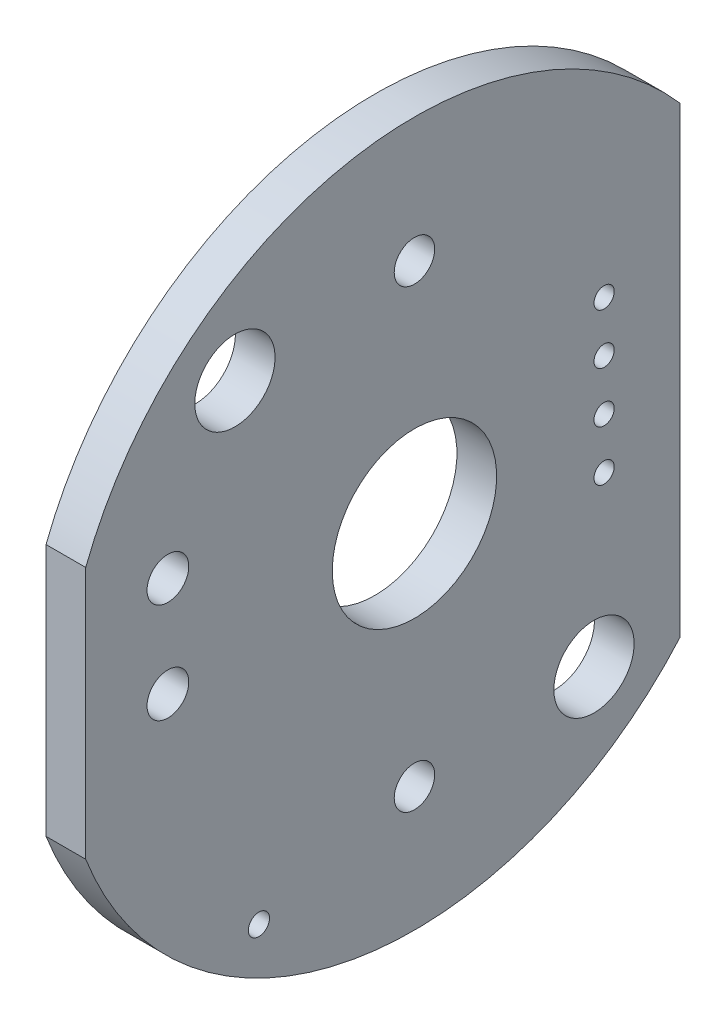
ISO-10303-21;
HEADER;
FILE_DESCRIPTION(('STEP AP214'),'2;1');
FILE_NAME('part.step','',(''),(''),'','','');
FILE_SCHEMA(('AUTOMOTIVE_DESIGN { 1 0 10303 214 1 1 1 1 }'));
ENDSEC;
DATA;
#1=APPLICATION_CONTEXT('core data for automotive mechanical design processes');
#2=APPLICATION_PROTOCOL_DEFINITION('international standard','automotive_design',2000,#1);
#3=PRODUCT_CONTEXT('',#1,'mechanical');
#4=PRODUCT('Part','Part','',(#3));
#5=PRODUCT_RELATED_PRODUCT_CATEGORY('part','',(#4));
#6=PRODUCT_DEFINITION_FORMATION('','',#4);
#7=PRODUCT_DEFINITION_CONTEXT('part definition',#1,'design');
#8=PRODUCT_DEFINITION('design','',#6,#7);
#9=PRODUCT_DEFINITION_SHAPE('','',#8);
#10=(LENGTH_UNIT() NAMED_UNIT(*) SI_UNIT(.MILLI.,.METRE.));
#11=(NAMED_UNIT(*) PLANE_ANGLE_UNIT() SI_UNIT($,.RADIAN.));
#12=(NAMED_UNIT(*) SI_UNIT($,.STERADIAN.) SOLID_ANGLE_UNIT());
#13=UNCERTAINTY_MEASURE_WITH_UNIT(LENGTH_MEASURE(1.E-05),#10,'distance_accuracy_value','');
#14=(GEOMETRIC_REPRESENTATION_CONTEXT(3) GLOBAL_UNCERTAINTY_ASSIGNED_CONTEXT((#13)) GLOBAL_UNIT_ASSIGNED_CONTEXT((#10,
#11,#12)) REPRESENTATION_CONTEXT('',''));
#15=CARTESIAN_POINT('',(0.,0.,0.));
#16=DIRECTION('',(0.,0.,1.));
#17=DIRECTION('',(1.,0.,0.));
#18=AXIS2_PLACEMENT_3D('',#15,#16,#17);
#19=CARTESIAN_POINT('',(-71.0500000000008,0.,0.344796446042563));
#20=DIRECTION('',(-1.,0.,0.));
#21=DIRECTION('',(0.,0.,1.));
#22=AXIS2_PLACEMENT_3D('',#19,#20,#21);
#23=PLANE('',#22);
#24=DIRECTION('',(0.,-1.,0.));
#25=VECTOR('',#24,1.);
#26=CARTESIAN_POINT('',(-71.0500000000008,-9.15,-10.5));
#27=LINE('',#26,#25);
#28=CARTESIAN_POINT('',(-71.0500000000008,9.14993426291181,-10.5));
#29=VERTEX_POINT('',#28);
#30=CARTESIAN_POINT('',(-71.0500000000008,-9.14993426291164,-10.5));
#31=VERTEX_POINT('',#30);
#32=EDGE_CURVE('E170',#29,#31,#27,.T.);
#33=ORIENTED_EDGE('',*,*,#32,.F.);
#34=CARTESIAN_POINT('',(-71.0500000000008,0.,0.));
#35=DIRECTION('',(-1.,0.,0.));
#36=DIRECTION('',(0.,-1.,0.));
#37=AXIS2_PLACEMENT_3D('',#34,#35,#36);
#38=CIRCLE('',#37,13.9273578619782);
#39=CARTESIAN_POINT('',(-71.0500000000008,4.99712887722608,13.));
#40=VERTEX_POINT('',#39);
#41=EDGE_CURVE('E197',#40,#29,#38,.T.);
#42=ORIENTED_EDGE('',*,*,#41,.F.);
#43=DIRECTION('',(0.,1.,0.));
#44=VECTOR('',#43,1.);
#45=CARTESIAN_POINT('',(-71.0500000000008,5.00000000000009,13.));
#46=LINE('',#45,#44);
#47=CARTESIAN_POINT('',(-71.0500000000008,-4.99712887722591,13.));
#48=VERTEX_POINT('',#47);
#49=EDGE_CURVE('E204',#48,#40,#46,.T.);
#50=ORIENTED_EDGE('',*,*,#49,.F.);
#51=CARTESIAN_POINT('',(-71.0500000000008,0.,0.));
#52=DIRECTION('',(-1.,0.,0.));
#53=DIRECTION('',(0.,-1.,0.));
#54=AXIS2_PLACEMENT_3D('',#51,#52,#53);
#55=CIRCLE('',#54,13.9273578619782);
#56=EDGE_CURVE('E11',#31,#48,#55,.T.);
#57=ORIENTED_EDGE('',*,*,#56,.F.);
#58=EDGE_LOOP('',(#33,#42,#50,#57));
#59=FACE_BOUND('',#58,.T.);
#60=CARTESIAN_POINT('',(-71.0500000000008,-9.,0.));
#61=DIRECTION('',(-1.,0.,0.));
#62=DIRECTION('',(0.,0.,1.));
#63=AXIS2_PLACEMENT_3D('',#60,#61,#62);
#64=CIRCLE('',#63,0.8001);
#65=CARTESIAN_POINT('',(-71.0500000000008,-9.,0.800099999999991));
#66=VERTEX_POINT('',#65);
#67=EDGE_CURVE('E20',#66,#66,#64,.T.);
#68=ORIENTED_EDGE('',*,*,#67,.T.);
#69=EDGE_LOOP('',(#68));
#70=FACE_BOUND('',#69,.T.);
#71=CARTESIAN_POINT('',(-71.0500000000008,9.,0.));
#72=DIRECTION('',(-1.,0.,0.));
#73=DIRECTION('',(0.,0.,1.));
#74=AXIS2_PLACEMENT_3D('',#71,#72,#73);
#75=CIRCLE('',#74,0.8001);
#76=CARTESIAN_POINT('',(-71.0500000000008,9.,0.800099999999991));
#77=VERTEX_POINT('',#76);
#78=EDGE_CURVE('E231',#77,#77,#75,.T.);
#79=ORIENTED_EDGE('',*,*,#78,.T.);
#80=EDGE_LOOP('',(#79));
#81=FACE_BOUND('',#80,.T.);
#82=CARTESIAN_POINT('',(-71.0500000000008,-8.44999999999991,-7.1));
#83=DIRECTION('',(-1.,0.,0.));
#84=DIRECTION('',(0.,0.,1.));
#85=AXIS2_PLACEMENT_3D('',#82,#83,#84);
#86=CIRCLE('',#85,1.5875);
#87=CARTESIAN_POINT('',(-71.0500000000008,-8.44999999999991,-5.5125));
#88=VERTEX_POINT('',#87);
#89=EDGE_CURVE('E232',#88,#88,#86,.T.);
#90=ORIENTED_EDGE('',*,*,#89,.T.);
#91=EDGE_LOOP('',(#90));
#92=FACE_BOUND('',#91,.T.);
#93=CARTESIAN_POINT('',(-71.0500000000008,-0.959999999999913,9.75));
#94=DIRECTION('',(-1.,0.,0.));
#95=DIRECTION('',(0.,0.,1.));
#96=AXIS2_PLACEMENT_3D('',#93,#94,#95);
#97=CIRCLE('',#96,0.825);
#98=CARTESIAN_POINT('',(-71.0500000000008,-0.959999999999913,10.575));
#99=VERTEX_POINT('',#98);
#100=EDGE_CURVE('E270',#99,#99,#97,.T.);
#101=ORIENTED_EDGE('',*,*,#100,.T.);
#102=EDGE_LOOP('',(#101));
#103=FACE_BOUND('',#102,.T.);
#104=CARTESIAN_POINT('',(-71.0500000000008,4.00000000000009,-7.5));
#105=DIRECTION('',(-1.,0.,0.));
#106=DIRECTION('',(0.,0.,1.));
#107=AXIS2_PLACEMENT_3D('',#104,#105,#106);
#108=CIRCLE('',#107,0.4);
#109=CARTESIAN_POINT('',(-71.0500000000008,4.00000000000009,-7.1));
#110=VERTEX_POINT('',#109);
#111=EDGE_CURVE('E223',#110,#110,#108,.T.);
#112=ORIENTED_EDGE('',*,*,#111,.T.);
#113=EDGE_LOOP('',(#112));
#114=FACE_BOUND('',#113,.T.);
#115=CARTESIAN_POINT('',(-71.0500000000008,0.,-7.5));
#116=DIRECTION('',(-1.,0.,0.));
#117=DIRECTION('',(0.,0.,1.));
#118=AXIS2_PLACEMENT_3D('',#115,#116,#117);
#119=CIRCLE('',#118,0.4);
#120=CARTESIAN_POINT('',(-71.0500000000008,0.,-7.1));
#121=VERTEX_POINT('',#120);
#122=EDGE_CURVE('E235',#121,#121,#119,.T.);
#123=ORIENTED_EDGE('',*,*,#122,.T.);
#124=EDGE_LOOP('',(#123));
#125=FACE_BOUND('',#124,.T.);
#126=CARTESIAN_POINT('',(-71.0500000000008,-1.99999999999992,-7.5));
#127=DIRECTION('',(-1.,0.,0.));
#128=DIRECTION('',(0.,0.,1.));
#129=AXIS2_PLACEMENT_3D('',#126,#127,#128);
#130=CIRCLE('',#129,0.4);
#131=CARTESIAN_POINT('',(-71.0500000000008,-1.99999999999992,-7.1));
#132=VERTEX_POINT('',#131);
#133=EDGE_CURVE('E219',#132,#132,#130,.T.);
#134=ORIENTED_EDGE('',*,*,#133,.T.);
#135=EDGE_LOOP('',(#134));
#136=FACE_BOUND('',#135,.T.);
#137=CARTESIAN_POINT('',(-71.0500000000008,2.00000000000009,-7.5));
#138=DIRECTION('',(-1.,0.,0.));
#139=DIRECTION('',(0.,0.,1.));
#140=AXIS2_PLACEMENT_3D('',#137,#138,#139);
#141=CIRCLE('',#140,0.4);
#142=CARTESIAN_POINT('',(-71.0500000000008,2.00000000000009,-7.1));
#143=VERTEX_POINT('',#142);
#144=EDGE_CURVE('E207',#143,#143,#141,.T.);
#145=ORIENTED_EDGE('',*,*,#144,.T.);
#146=EDGE_LOOP('',(#145));
#147=FACE_BOUND('',#146,.T.);
#148=CARTESIAN_POINT('',(-71.0500000000008,-10.65,6.15));
#149=DIRECTION('',(-1.,0.,0.));
#150=DIRECTION('',(0.,0.,1.));
#151=AXIS2_PLACEMENT_3D('',#148,#149,#150);
#152=CIRCLE('',#151,0.4191);
#153=CARTESIAN_POINT('',(-71.0500000000008,-10.65,6.5691));
#154=VERTEX_POINT('',#153);
#155=EDGE_CURVE('E238',#154,#154,#152,.T.);
#156=ORIENTED_EDGE('',*,*,#155,.T.);
#157=EDGE_LOOP('',(#156));
#158=FACE_BOUND('',#157,.T.);
#159=CARTESIAN_POINT('',(-71.0500000000008,3.00000000000009,9.75));
#160=DIRECTION('',(-1.,0.,0.));
#161=DIRECTION('',(0.,0.,1.));
#162=AXIS2_PLACEMENT_3D('',#159,#160,#161);
#163=CIRCLE('',#162,0.825);
#164=CARTESIAN_POINT('',(-71.0500000000008,3.00000000000009,10.575));
#165=VERTEX_POINT('',#164);
#166=EDGE_CURVE('E242',#165,#165,#163,.T.);
#167=ORIENTED_EDGE('',*,*,#166,.T.);
#168=EDGE_LOOP('',(#167));
#169=FACE_BOUND('',#168,.T.);
#170=CARTESIAN_POINT('',(-71.0500000000008,8.45000000000009,7.1));
#171=DIRECTION('',(-1.,0.,0.));
#172=DIRECTION('',(0.,0.,1.));
#173=AXIS2_PLACEMENT_3D('',#170,#171,#172);
#174=CIRCLE('',#173,1.5875);
#175=CARTESIAN_POINT('',(-71.0500000000008,8.45000000000009,8.6875));
#176=VERTEX_POINT('',#175);
#177=EDGE_CURVE('E215',#176,#176,#174,.T.);
#178=ORIENTED_EDGE('',*,*,#177,.T.);
#179=EDGE_LOOP('',(#178));
#180=FACE_BOUND('',#179,.T.);
#181=CARTESIAN_POINT('',(-71.0500000000008,0.,0.));
#182=DIRECTION('',(-1.,0.,0.));
#183=DIRECTION('',(0.,0.,1.));
#184=AXIS2_PLACEMENT_3D('',#181,#182,#183);
#185=CIRCLE('',#184,3.25);
#186=CARTESIAN_POINT('',(-71.0500000000008,0.,3.25));
#187=VERTEX_POINT('',#186);
#188=EDGE_CURVE('E216',#187,#187,#185,.T.);
#189=ORIENTED_EDGE('',*,*,#188,.T.);
#190=EDGE_LOOP('',(#189));
#191=FACE_BOUND('',#190,.T.);
#192=ADVANCED_FACE('F16',(#59,#70,#81,#92,#103,#114,#125,#136,#147,#158,#169,#180,#191),#23,.F.);
#193=CARTESIAN_POINT('',(-72.6197200000008,0.,0.));
#194=DIRECTION('',(1.,0.,0.));
#195=DIRECTION('',(0.,0.,-1.));
#196=AXIS2_PLACEMENT_3D('',#193,#194,#195);
#197=CYLINDRICAL_SURFACE('',#196,13.9273578619782);
#198=ORIENTED_EDGE('',*,*,#56,.T.);
#199=DIRECTION('',(1.,0.,0.));
#200=VECTOR('',#199,1.);
#201=CARTESIAN_POINT('',(-72.6197200000008,-4.99712887722591,13.));
#202=LINE('',#201,#200);
#203=CARTESIAN_POINT('',(-72.6197200000008,-4.99712887722591,13.));
#204=VERTEX_POINT('',#203);
#205=EDGE_CURVE('E27',#204,#48,#202,.T.);
#206=ORIENTED_EDGE('',*,*,#205,.F.);
#207=CARTESIAN_POINT('',(-72.6197200000008,0.,0.));
#208=DIRECTION('',(-1.,0.,0.));
#209=DIRECTION('',(0.,-1.,0.));
#210=AXIS2_PLACEMENT_3D('',#207,#208,#209);
#211=CIRCLE('',#210,13.9273578619782);
#212=CARTESIAN_POINT('',(-72.6197200000008,-9.14993426291164,-10.5));
#213=VERTEX_POINT('',#212);
#214=EDGE_CURVE('E175',#213,#204,#211,.T.);
#215=ORIENTED_EDGE('',*,*,#214,.F.);
#216=DIRECTION('',(1.,0.,0.));
#217=VECTOR('',#216,1.);
#218=CARTESIAN_POINT('',(-71.0500000000008,-9.14993426291164,-10.5));
#219=LINE('',#218,#217);
#220=EDGE_CURVE('E162',#213,#31,#219,.T.);
#221=ORIENTED_EDGE('',*,*,#220,.T.);
#222=EDGE_LOOP('',(#198,#206,#215,#221));
#223=FACE_BOUND('',#222,.T.);
#224=ADVANCED_FACE('F176',(#223),#197,.T.);
#225=CARTESIAN_POINT('',(-72.6197200000008,5.00000000000009,13.));
#226=DIRECTION('',(0.,0.,1.));
#227=DIRECTION('',(1.,0.,0.));
#228=AXIS2_PLACEMENT_3D('',#225,#226,#227);
#229=PLANE('',#228);
#230=ORIENTED_EDGE('',*,*,#49,.T.);
#231=DIRECTION('',(1.,0.,0.));
#232=VECTOR('',#231,1.);
#233=CARTESIAN_POINT('',(-72.6197200000008,4.99712887722608,13.));
#234=LINE('',#233,#232);
#235=CARTESIAN_POINT('',(-72.6197200000008,4.99712887722609,13.));
#236=VERTEX_POINT('',#235);
#237=EDGE_CURVE('E200',#236,#40,#234,.T.);
#238=ORIENTED_EDGE('',*,*,#237,.F.);
#239=DIRECTION('',(0.,1.,0.));
#240=VECTOR('',#239,1.);
#241=CARTESIAN_POINT('',(-72.6197200000008,0.,13.));
#242=LINE('',#241,#240);
#243=EDGE_CURVE('E181',#204,#236,#242,.T.);
#244=ORIENTED_EDGE('',*,*,#243,.F.);
#245=ORIENTED_EDGE('',*,*,#205,.T.);
#246=EDGE_LOOP('',(#230,#238,#244,#245));
#247=FACE_BOUND('',#246,.T.);
#248=ADVANCED_FACE('F310',(#247),#229,.T.);
#249=CARTESIAN_POINT('',(-72.6197200000008,0.,0.));
#250=DIRECTION('',(1.,0.,0.));
#251=DIRECTION('',(0.,0.,-1.));
#252=AXIS2_PLACEMENT_3D('',#249,#250,#251);
#253=CYLINDRICAL_SURFACE('',#252,13.9273578619782);
#254=ORIENTED_EDGE('',*,*,#41,.T.);
#255=DIRECTION('',(1.,0.,0.));
#256=VECTOR('',#255,1.);
#257=CARTESIAN_POINT('',(-72.6197200000008,9.14993426291182,-10.5));
#258=LINE('',#257,#256);
#259=CARTESIAN_POINT('',(-72.6197200000008,9.14993426291182,-10.5));
#260=VERTEX_POINT('',#259);
#261=EDGE_CURVE('E172',#260,#29,#258,.T.);
#262=ORIENTED_EDGE('',*,*,#261,.F.);
#263=CARTESIAN_POINT('',(-72.6197200000008,0.,0.));
#264=DIRECTION('',(-1.,0.,0.));
#265=DIRECTION('',(0.,-1.,0.));
#266=AXIS2_PLACEMENT_3D('',#263,#264,#265);
#267=CIRCLE('',#266,13.9273578619782);
#268=EDGE_CURVE('E185',#236,#260,#267,.T.);
#269=ORIENTED_EDGE('',*,*,#268,.F.);
#270=ORIENTED_EDGE('',*,*,#237,.T.);
#271=EDGE_LOOP('',(#254,#262,#269,#270));
#272=FACE_BOUND('',#271,.T.);
#273=ADVANCED_FACE('F316',(#272),#253,.T.);
#274=CARTESIAN_POINT('',(-72.6197200000008,-9.15,-10.5));
#275=DIRECTION('',(0.,0.,-1.));
#276=DIRECTION('',(0.,-1.,0.));
#277=AXIS2_PLACEMENT_3D('',#274,#275,#276);
#278=PLANE('',#277);
#279=ORIENTED_EDGE('',*,*,#32,.T.);
#280=ORIENTED_EDGE('',*,*,#220,.F.);
#281=DIRECTION('',(0.,-1.,0.));
#282=VECTOR('',#281,1.);
#283=CARTESIAN_POINT('',(-72.6197200000008,0.,-10.5));
#284=LINE('',#283,#282);
#285=EDGE_CURVE('E167',#260,#213,#284,.T.);
#286=ORIENTED_EDGE('',*,*,#285,.F.);
#287=ORIENTED_EDGE('',*,*,#261,.T.);
#288=EDGE_LOOP('',(#279,#280,#286,#287));
#289=FACE_BOUND('',#288,.T.);
#290=ADVANCED_FACE('F164',(#289),#278,.T.);
#291=CARTESIAN_POINT('',(-72.6197200000008,0.,0.344796446042562));
#292=DIRECTION('',(-1.,0.,0.));
#293=DIRECTION('',(0.,0.,1.));
#294=AXIS2_PLACEMENT_3D('',#291,#292,#293);
#295=PLANE('',#294);
#296=ORIENTED_EDGE('',*,*,#268,.T.);
#297=ORIENTED_EDGE('',*,*,#285,.T.);
#298=ORIENTED_EDGE('',*,*,#214,.T.);
#299=ORIENTED_EDGE('',*,*,#243,.T.);
#300=EDGE_LOOP('',(#296,#297,#298,#299));
#301=FACE_BOUND('',#300,.T.);
#302=CARTESIAN_POINT('',(-72.6197200000008,-9.,0.));
#303=DIRECTION('',(1.,0.,0.));
#304=DIRECTION('',(0.,0.,1.));
#305=AXIS2_PLACEMENT_3D('',#302,#303,#304);
#306=CIRCLE('',#305,0.8001);
#307=CARTESIAN_POINT('',(-72.6197200000008,-9.,0.800099999999991));
#308=VERTEX_POINT('',#307);
#309=EDGE_CURVE('E191',#308,#308,#306,.T.);
#310=ORIENTED_EDGE('',*,*,#309,.T.);
#311=EDGE_LOOP('',(#310));
#312=FACE_BOUND('',#311,.T.);
#313=CARTESIAN_POINT('',(-72.6197200000008,9.,0.));
#314=DIRECTION('',(1.,0.,0.));
#315=DIRECTION('',(0.,0.,1.));
#316=AXIS2_PLACEMENT_3D('',#313,#314,#315);
#317=CIRCLE('',#316,0.8001);
#318=CARTESIAN_POINT('',(-72.6197200000008,9.,0.800099999999991));
#319=VERTEX_POINT('',#318);
#320=EDGE_CURVE('E247',#319,#319,#317,.T.);
#321=ORIENTED_EDGE('',*,*,#320,.T.);
#322=EDGE_LOOP('',(#321));
#323=FACE_BOUND('',#322,.T.);
#324=CARTESIAN_POINT('',(-72.6197200000008,-8.44999999999991,-7.1));
#325=DIRECTION('',(1.,0.,0.));
#326=DIRECTION('',(0.,0.,1.));
#327=AXIS2_PLACEMENT_3D('',#324,#325,#326);
#328=CIRCLE('',#327,1.5875);
#329=CARTESIAN_POINT('',(-72.6197200000008,-8.44999999999991,-5.5125));
#330=VERTEX_POINT('',#329);
#331=EDGE_CURVE('E228',#330,#330,#328,.T.);
#332=ORIENTED_EDGE('',*,*,#331,.T.);
#333=EDGE_LOOP('',(#332));
#334=FACE_BOUND('',#333,.T.);
#335=CARTESIAN_POINT('',(-72.6197200000008,-0.959999999999911,9.75));
#336=DIRECTION('',(1.,0.,0.));
#337=DIRECTION('',(0.,0.,1.));
#338=AXIS2_PLACEMENT_3D('',#335,#336,#337);
#339=CIRCLE('',#338,0.825);
#340=CARTESIAN_POINT('',(-72.6197200000008,-0.959999999999911,10.575));
#341=VERTEX_POINT('',#340);
#342=EDGE_CURVE('E264',#341,#341,#339,.T.);
#343=ORIENTED_EDGE('',*,*,#342,.T.);
#344=EDGE_LOOP('',(#343));
#345=FACE_BOUND('',#344,.T.);
#346=CARTESIAN_POINT('',(-72.6197200000008,4.00000000000009,-7.5));
#347=DIRECTION('',(1.,0.,0.));
#348=DIRECTION('',(0.,0.,1.));
#349=AXIS2_PLACEMENT_3D('',#346,#347,#348);
#350=CIRCLE('',#349,0.4);
#351=CARTESIAN_POINT('',(-72.6197200000008,4.00000000000009,-7.1));
#352=VERTEX_POINT('',#351);
#353=EDGE_CURVE('E226',#352,#352,#350,.T.);
#354=ORIENTED_EDGE('',*,*,#353,.T.);
#355=EDGE_LOOP('',(#354));
#356=FACE_BOUND('',#355,.T.);
#357=CARTESIAN_POINT('',(-72.6197200000008,0.,-7.5));
#358=DIRECTION('',(1.,0.,0.));
#359=DIRECTION('',(0.,0.,1.));
#360=AXIS2_PLACEMENT_3D('',#357,#358,#359);
#361=CIRCLE('',#360,0.4);
#362=CARTESIAN_POINT('',(-72.6197200000008,0.,-7.1));
#363=VERTEX_POINT('',#362);
#364=EDGE_CURVE('E227',#363,#363,#361,.T.);
#365=ORIENTED_EDGE('',*,*,#364,.T.);
#366=EDGE_LOOP('',(#365));
#367=FACE_BOUND('',#366,.T.);
#368=CARTESIAN_POINT('',(-72.6197200000008,-1.99999999999991,-7.5));
#369=DIRECTION('',(1.,0.,0.));
#370=DIRECTION('',(0.,0.,1.));
#371=AXIS2_PLACEMENT_3D('',#368,#369,#370);
#372=CIRCLE('',#371,0.4);
#373=CARTESIAN_POINT('',(-72.6197200000008,-1.99999999999991,-7.1));
#374=VERTEX_POINT('',#373);
#375=EDGE_CURVE('E222',#374,#374,#372,.T.);
#376=ORIENTED_EDGE('',*,*,#375,.T.);
#377=EDGE_LOOP('',(#376));
#378=FACE_BOUND('',#377,.T.);
#379=CARTESIAN_POINT('',(-72.6197200000008,2.00000000000009,-7.5));
#380=DIRECTION('',(1.,0.,0.));
#381=DIRECTION('',(0.,0.,1.));
#382=AXIS2_PLACEMENT_3D('',#379,#380,#381);
#383=CIRCLE('',#382,0.4);
#384=CARTESIAN_POINT('',(-72.6197200000008,2.00000000000009,-7.1));
#385=VERTEX_POINT('',#384);
#386=EDGE_CURVE('E210',#385,#385,#383,.T.);
#387=ORIENTED_EDGE('',*,*,#386,.T.);
#388=EDGE_LOOP('',(#387));
#389=FACE_BOUND('',#388,.T.);
#390=CARTESIAN_POINT('',(-72.6197200000008,-10.65,6.15));
#391=DIRECTION('',(1.,0.,0.));
#392=DIRECTION('',(0.,0.,1.));
#393=AXIS2_PLACEMENT_3D('',#390,#391,#392);
#394=CIRCLE('',#393,0.4191);
#395=CARTESIAN_POINT('',(-72.6197200000008,-10.65,6.5691));
#396=VERTEX_POINT('',#395);
#397=EDGE_CURVE('E211',#396,#396,#394,.T.);
#398=ORIENTED_EDGE('',*,*,#397,.T.);
#399=EDGE_LOOP('',(#398));
#400=FACE_BOUND('',#399,.T.);
#401=CARTESIAN_POINT('',(-72.6197200000008,3.00000000000009,9.75));
#402=DIRECTION('',(1.,0.,0.));
#403=DIRECTION('',(0.,0.,1.));
#404=AXIS2_PLACEMENT_3D('',#401,#402,#403);
#405=CIRCLE('',#404,0.825);
#406=CARTESIAN_POINT('',(-72.6197200000008,3.00000000000009,10.575));
#407=VERTEX_POINT('',#406);
#408=EDGE_CURVE('E241',#407,#407,#405,.T.);
#409=ORIENTED_EDGE('',*,*,#408,.T.);
#410=EDGE_LOOP('',(#409));
#411=FACE_BOUND('',#410,.T.);
#412=CARTESIAN_POINT('',(-72.6197200000008,8.45000000000009,7.1));
#413=DIRECTION('',(1.,0.,0.));
#414=DIRECTION('',(0.,0.,1.));
#415=AXIS2_PLACEMENT_3D('',#412,#413,#414);
#416=CIRCLE('',#415,1.5875);
#417=CARTESIAN_POINT('',(-72.6197200000008,8.45000000000009,8.6875));
#418=VERTEX_POINT('',#417);
#419=EDGE_CURVE('E194',#418,#418,#416,.T.);
#420=ORIENTED_EDGE('',*,*,#419,.T.);
#421=EDGE_LOOP('',(#420));
#422=FACE_BOUND('',#421,.T.);
#423=CARTESIAN_POINT('',(-72.6197200000008,0.,0.));
#424=DIRECTION('',(1.,0.,0.));
#425=DIRECTION('',(0.,0.,1.));
#426=AXIS2_PLACEMENT_3D('',#423,#424,#425);
#427=CIRCLE('',#426,3.25);
#428=CARTESIAN_POINT('',(-72.6197200000008,0.,3.25));
#429=VERTEX_POINT('',#428);
#430=EDGE_CURVE('E212',#429,#429,#427,.T.);
#431=ORIENTED_EDGE('',*,*,#430,.T.);
#432=EDGE_LOOP('',(#431));
#433=FACE_BOUND('',#432,.T.);
#434=ADVANCED_FACE('F18',(#301,#312,#323,#334,#345,#356,#367,#378,#389,#400,#411,#422,#433),
#295,.T.);
#435=CARTESIAN_POINT('',(-72.6197200000008,-9.,0.));
#436=DIRECTION('',(-1.,0.,0.));
#437=DIRECTION('',(0.,0.,1.));
#438=AXIS2_PLACEMENT_3D('',#435,#436,#437);
#439=CYLINDRICAL_SURFACE('',#438,0.8001);
#440=ORIENTED_EDGE('',*,*,#309,.F.);
#441=EDGE_LOOP('',(#440));
#442=FACE_BOUND('',#441,.T.);
#443=ORIENTED_EDGE('',*,*,#67,.F.);
#444=EDGE_LOOP('',(#443));
#445=FACE_BOUND('',#444,.T.);
#446=ADVANCED_FACE('F288',(#442,#445),#439,.F.);
#447=CARTESIAN_POINT('',(-72.6197200000008,9.,0.));
#448=DIRECTION('',(-1.,0.,0.));
#449=DIRECTION('',(0.,0.,1.));
#450=AXIS2_PLACEMENT_3D('',#447,#448,#449);
#451=CYLINDRICAL_SURFACE('',#450,0.8001);
#452=ORIENTED_EDGE('',*,*,#320,.F.);
#453=EDGE_LOOP('',(#452));
#454=FACE_BOUND('',#453,.T.);
#455=ORIENTED_EDGE('',*,*,#78,.F.);
#456=EDGE_LOOP('',(#455));
#457=FACE_BOUND('',#456,.T.);
#458=ADVANCED_FACE('F285',(#454,#457),#451,.F.);
#459=CARTESIAN_POINT('',(-72.6197200000008,-8.44999999999991,-7.1));
#460=DIRECTION('',(-1.,0.,0.));
#461=DIRECTION('',(0.,0.,1.));
#462=AXIS2_PLACEMENT_3D('',#459,#460,#461);
#463=CYLINDRICAL_SURFACE('',#462,1.5875);
#464=ORIENTED_EDGE('',*,*,#331,.F.);
#465=EDGE_LOOP('',(#464));
#466=FACE_BOUND('',#465,.T.);
#467=ORIENTED_EDGE('',*,*,#89,.F.);
#468=EDGE_LOOP('',(#467));
#469=FACE_BOUND('',#468,.T.);
#470=ADVANCED_FACE('F287',(#466,#469),#463,.F.);
#471=CARTESIAN_POINT('',(-72.6197200000008,-0.959999999999911,9.75));
#472=DIRECTION('',(-1.,0.,0.));
#473=DIRECTION('',(0.,0.,1.));
#474=AXIS2_PLACEMENT_3D('',#471,#472,#473);
#475=CYLINDRICAL_SURFACE('',#474,0.825);
#476=ORIENTED_EDGE('',*,*,#342,.F.);
#477=EDGE_LOOP('',(#476));
#478=FACE_BOUND('',#477,.T.);
#479=ORIENTED_EDGE('',*,*,#100,.F.);
#480=EDGE_LOOP('',(#479));
#481=FACE_BOUND('',#480,.T.);
#482=ADVANCED_FACE('F296',(#478,#481),#475,.F.);
#483=CARTESIAN_POINT('',(-72.6197200000008,4.00000000000009,-7.5));
#484=DIRECTION('',(-1.,0.,0.));
#485=DIRECTION('',(0.,0.,1.));
#486=AXIS2_PLACEMENT_3D('',#483,#484,#485);
#487=CYLINDRICAL_SURFACE('',#486,0.4);
#488=ORIENTED_EDGE('',*,*,#353,.F.);
#489=EDGE_LOOP('',(#488));
#490=FACE_BOUND('',#489,.T.);
#491=ORIENTED_EDGE('',*,*,#111,.F.);
#492=EDGE_LOOP('',(#491));
#493=FACE_BOUND('',#492,.T.);
#494=ADVANCED_FACE('F320',(#490,#493),#487,.F.);
#495=CARTESIAN_POINT('',(-72.6197200000008,0.,-7.5));
#496=DIRECTION('',(-1.,0.,0.));
#497=DIRECTION('',(0.,0.,1.));
#498=AXIS2_PLACEMENT_3D('',#495,#496,#497);
#499=CYLINDRICAL_SURFACE('',#498,0.4);
#500=ORIENTED_EDGE('',*,*,#364,.F.);
#501=EDGE_LOOP('',(#500));
#502=FACE_BOUND('',#501,.T.);
#503=ORIENTED_EDGE('',*,*,#122,.F.);
#504=EDGE_LOOP('',(#503));
#505=FACE_BOUND('',#504,.T.);
#506=ADVANCED_FACE('F317',(#502,#505),#499,.F.);
#507=CARTESIAN_POINT('',(-72.6197200000008,-1.99999999999991,-7.5));
#508=DIRECTION('',(-1.,0.,0.));
#509=DIRECTION('',(0.,0.,1.));
#510=AXIS2_PLACEMENT_3D('',#507,#508,#509);
#511=CYLINDRICAL_SURFACE('',#510,0.4);
#512=ORIENTED_EDGE('',*,*,#375,.F.);
#513=EDGE_LOOP('',(#512));
#514=FACE_BOUND('',#513,.T.);
#515=ORIENTED_EDGE('',*,*,#133,.F.);
#516=EDGE_LOOP('',(#515));
#517=FACE_BOUND('',#516,.T.);
#518=ADVANCED_FACE('F319',(#514,#517),#511,.F.);
#519=CARTESIAN_POINT('',(-72.6197200000008,2.00000000000009,-7.5));
#520=DIRECTION('',(-1.,0.,0.));
#521=DIRECTION('',(0.,0.,1.));
#522=AXIS2_PLACEMENT_3D('',#519,#520,#521);
#523=CYLINDRICAL_SURFACE('',#522,0.4);
#524=ORIENTED_EDGE('',*,*,#386,.F.);
#525=EDGE_LOOP('',(#524));
#526=FACE_BOUND('',#525,.T.);
#527=ORIENTED_EDGE('',*,*,#144,.F.);
#528=EDGE_LOOP('',(#527));
#529=FACE_BOUND('',#528,.T.);
#530=ADVANCED_FACE('F326',(#526,#529),#523,.F.);
#531=CARTESIAN_POINT('',(-72.6197200000008,-10.65,6.15));
#532=DIRECTION('',(-1.,0.,0.));
#533=DIRECTION('',(0.,0.,1.));
#534=AXIS2_PLACEMENT_3D('',#531,#532,#533);
#535=CYLINDRICAL_SURFACE('',#534,0.4191);
#536=ORIENTED_EDGE('',*,*,#397,.F.);
#537=EDGE_LOOP('',(#536));
#538=FACE_BOUND('',#537,.T.);
#539=ORIENTED_EDGE('',*,*,#155,.F.);
#540=EDGE_LOOP('',(#539));
#541=FACE_BOUND('',#540,.T.);
#542=ADVANCED_FACE('F366',(#538,#541),#535,.F.);
#543=CARTESIAN_POINT('',(-72.6197200000008,3.00000000000009,9.75));
#544=DIRECTION('',(-1.,0.,0.));
#545=DIRECTION('',(0.,0.,1.));
#546=AXIS2_PLACEMENT_3D('',#543,#544,#545);
#547=CYLINDRICAL_SURFACE('',#546,0.825);
#548=ORIENTED_EDGE('',*,*,#408,.F.);
#549=EDGE_LOOP('',(#548));
#550=FACE_BOUND('',#549,.T.);
#551=ORIENTED_EDGE('',*,*,#166,.F.);
#552=EDGE_LOOP('',(#551));
#553=FACE_BOUND('',#552,.T.);
#554=ADVANCED_FACE('F356',(#550,#553),#547,.F.);
#555=CARTESIAN_POINT('',(-72.6197200000008,8.45000000000009,7.1));
#556=DIRECTION('',(-1.,0.,0.));
#557=DIRECTION('',(0.,0.,1.));
#558=AXIS2_PLACEMENT_3D('',#555,#556,#557);
#559=CYLINDRICAL_SURFACE('',#558,1.5875);
#560=ORIENTED_EDGE('',*,*,#419,.F.);
#561=EDGE_LOOP('',(#560));
#562=FACE_BOUND('',#561,.T.);
#563=ORIENTED_EDGE('',*,*,#177,.F.);
#564=EDGE_LOOP('',(#563));
#565=FACE_BOUND('',#564,.T.);
#566=ADVANCED_FACE('F350',(#562,#565),#559,.F.);
#567=CARTESIAN_POINT('',(-72.6197200000008,0.,0.));
#568=DIRECTION('',(-1.,0.,0.));
#569=DIRECTION('',(0.,0.,1.));
#570=AXIS2_PLACEMENT_3D('',#567,#568,#569);
#571=CYLINDRICAL_SURFACE('',#570,3.25);
#572=ORIENTED_EDGE('',*,*,#430,.F.);
#573=EDGE_LOOP('',(#572));
#574=FACE_BOUND('',#573,.T.);
#575=ORIENTED_EDGE('',*,*,#188,.F.);
#576=EDGE_LOOP('',(#575));
#577=FACE_BOUND('',#576,.T.);
#578=ADVANCED_FACE('F348',(#574,#577),#571,.F.);
#579=CLOSED_SHELL('',(#192,#224,#248,#273,#290,#434,#446,#458,#470,#482,#494,#506,#518,#530,
#542,#554,#566,#578));
#580=MANIFOLD_SOLID_BREP('B1',#579);
#581=ADVANCED_BREP_SHAPE_REPRESENTATION('',(#18,#580),#14);
#582=SHAPE_DEFINITION_REPRESENTATION(#9,#581);
ENDSEC;
END-ISO-10303-21;
